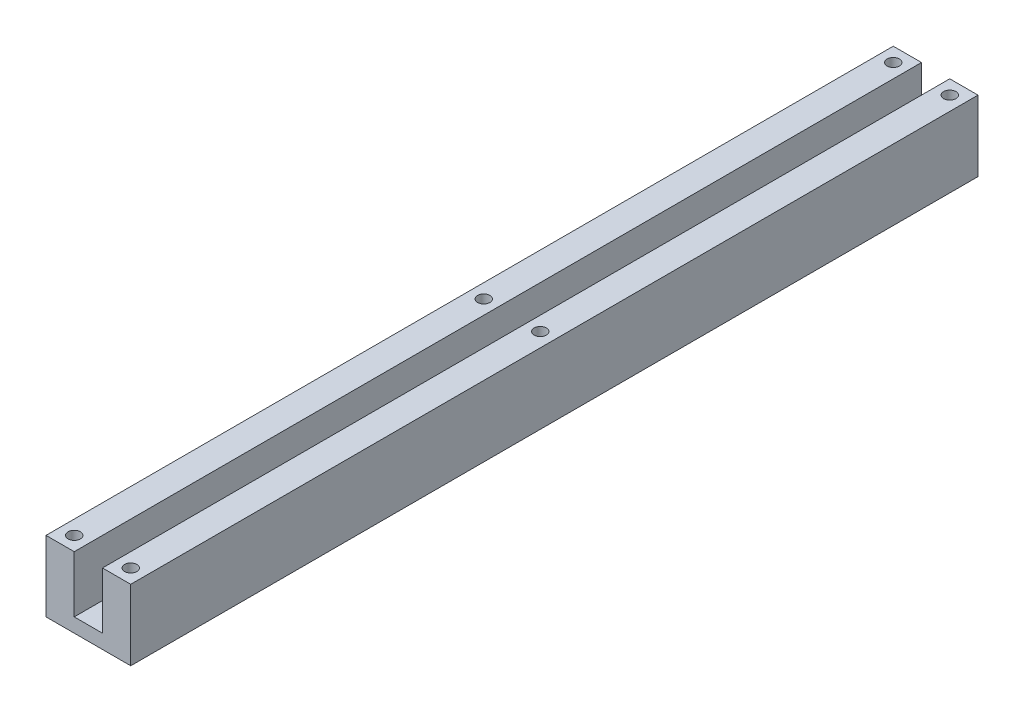
ISO-10303-21;
HEADER;
FILE_DESCRIPTION(('STEP AP214'),'2;1');
FILE_NAME('part.step','',(''),(''),'','','');
FILE_SCHEMA(('AUTOMOTIVE_DESIGN { 1 0 10303 214 1 1 1 1 }'));
ENDSEC;
DATA;
#1=APPLICATION_CONTEXT('core data for automotive mechanical design processes');
#2=APPLICATION_PROTOCOL_DEFINITION('international standard','automotive_design',2000,#1);
#3=PRODUCT_CONTEXT('',#1,'mechanical');
#4=PRODUCT('Part','Part','',(#3));
#5=PRODUCT_RELATED_PRODUCT_CATEGORY('part','',(#4));
#6=PRODUCT_DEFINITION_FORMATION('','',#4);
#7=PRODUCT_DEFINITION_CONTEXT('part definition',#1,'design');
#8=PRODUCT_DEFINITION('design','',#6,#7);
#9=PRODUCT_DEFINITION_SHAPE('','',#8);
#10=(LENGTH_UNIT() NAMED_UNIT(*) SI_UNIT(.MILLI.,.METRE.));
#11=(NAMED_UNIT(*) PLANE_ANGLE_UNIT() SI_UNIT($,.RADIAN.));
#12=(NAMED_UNIT(*) SI_UNIT($,.STERADIAN.) SOLID_ANGLE_UNIT());
#13=UNCERTAINTY_MEASURE_WITH_UNIT(LENGTH_MEASURE(1.E-05),#10,'distance_accuracy_value','');
#14=(GEOMETRIC_REPRESENTATION_CONTEXT(3) GLOBAL_UNCERTAINTY_ASSIGNED_CONTEXT((#13)) GLOBAL_UNIT_ASSIGNED_CONTEXT((#10,
#11,#12)) REPRESENTATION_CONTEXT('',''));
#15=CARTESIAN_POINT('',(0.,0.,0.));
#16=DIRECTION('',(0.,0.,1.));
#17=DIRECTION('',(1.,0.,0.));
#18=AXIS2_PLACEMENT_3D('',#15,#16,#17);
#19=CARTESIAN_POINT('',(-9.525,12.7,101.6));
#20=DIRECTION('',(1.,0.,0.));
#21=DIRECTION('',(0.,1.,0.));
#22=AXIS2_PLACEMENT_3D('',#19,#20,#21);
#23=PLANE('',#22);
#24=DIRECTION('',(0.,1.,0.));
#25=VECTOR('',#24,1.);
#26=CARTESIAN_POINT('',(-9.525,12.7,-88.9));
#27=LINE('',#26,#25);
#28=CARTESIAN_POINT('',(-9.525,-3.175,-88.9));
#29=VERTEX_POINT('',#28);
#30=CARTESIAN_POINT('',(-9.525,12.7,-88.9));
#31=VERTEX_POINT('',#30);
#32=EDGE_CURVE('E51',#29,#31,#27,.T.);
#33=ORIENTED_EDGE('',*,*,#32,.F.);
#34=DIRECTION('',(0.,0.,-1.));
#35=VECTOR('',#34,1.);
#36=CARTESIAN_POINT('',(-9.525,-3.175,101.6));
#37=LINE('',#36,#35);
#38=CARTESIAN_POINT('',(-9.525,-3.175,101.6));
#39=VERTEX_POINT('',#38);
#40=EDGE_CURVE('E11',#39,#29,#37,.T.);
#41=ORIENTED_EDGE('',*,*,#40,.F.);
#42=DIRECTION('',(0.,-1.,0.));
#43=VECTOR('',#42,1.);
#44=CARTESIAN_POINT('',(-9.525,12.7,101.6));
#45=LINE('',#44,#43);
#46=CARTESIAN_POINT('',(-9.525,12.7,101.6));
#47=VERTEX_POINT('',#46);
#48=EDGE_CURVE('E179',#47,#39,#45,.T.);
#49=ORIENTED_EDGE('',*,*,#48,.F.);
#50=DIRECTION('',(0.,0.,-1.));
#51=VECTOR('',#50,1.);
#52=CARTESIAN_POINT('',(-9.525,12.7,101.6));
#53=LINE('',#52,#51);
#54=EDGE_CURVE('E168',#47,#31,#53,.T.);
#55=ORIENTED_EDGE('',*,*,#54,.T.);
#56=EDGE_LOOP('',(#33,#41,#49,#55));
#57=FACE_BOUND('',#56,.T.);
#58=ADVANCED_FACE('F35',(#57),#23,.F.);
#59=CARTESIAN_POINT('',(-9.525,-3.175,101.6));
#60=DIRECTION('',(0.,1.,0.));
#61=DIRECTION('',(-1.,0.,0.));
#62=AXIS2_PLACEMENT_3D('',#59,#60,#61);
#63=PLANE('',#62);
#64=CARTESIAN_POINT('',(6.35,-3.175,98.425));
#65=DIRECTION('',(0.,1.,0.));
#66=DIRECTION('',(-1.,0.,0.));
#67=AXIS2_PLACEMENT_3D('',#64,#65,#66);
#68=CIRCLE('',#67,1.3890625);
#69=CARTESIAN_POINT('',(4.9609375,-3.175,98.425));
#70=VERTEX_POINT('',#69);
#71=EDGE_CURVE('E356',#70,#70,#68,.T.);
#72=ORIENTED_EDGE('',*,*,#71,.T.);
#73=EDGE_LOOP('',(#72));
#74=FACE_BOUND('',#73,.T.);
#75=CARTESIAN_POINT('',(-6.35,-3.175,6.35));
#76=DIRECTION('',(0.,1.,0.));
#77=DIRECTION('',(-1.,0.,0.));
#78=AXIS2_PLACEMENT_3D('',#75,#76,#77);
#79=CIRCLE('',#78,1.3890625);
#80=CARTESIAN_POINT('',(-7.7390625,-3.175,6.35));
#81=VERTEX_POINT('',#80);
#82=EDGE_CURVE('E354',#81,#81,#79,.T.);
#83=ORIENTED_EDGE('',*,*,#82,.T.);
#84=EDGE_LOOP('',(#83));
#85=FACE_BOUND('',#84,.T.);
#86=CARTESIAN_POINT('',(6.35,-3.175,6.35));
#87=DIRECTION('',(0.,1.,0.));
#88=DIRECTION('',(-1.,0.,0.));
#89=AXIS2_PLACEMENT_3D('',#86,#87,#88);
#90=CIRCLE('',#89,1.3890625);
#91=CARTESIAN_POINT('',(4.96093750000001,-3.175,6.35));
#92=VERTEX_POINT('',#91);
#93=EDGE_CURVE('E350',#92,#92,#90,.T.);
#94=ORIENTED_EDGE('',*,*,#93,.T.);
#95=EDGE_LOOP('',(#94));
#96=FACE_BOUND('',#95,.T.);
#97=CARTESIAN_POINT('',(-6.35,-3.175,-85.725));
#98=DIRECTION('',(0.,1.,0.));
#99=DIRECTION('',(-1.,0.,0.));
#100=AXIS2_PLACEMENT_3D('',#97,#98,#99);
#101=CIRCLE('',#100,1.3890625);
#102=CARTESIAN_POINT('',(-7.7390625,-3.175,-85.725));
#103=VERTEX_POINT('',#102);
#104=EDGE_CURVE('E347',#103,#103,#101,.T.);
#105=ORIENTED_EDGE('',*,*,#104,.T.);
#106=EDGE_LOOP('',(#105));
#107=FACE_BOUND('',#106,.T.);
#108=CARTESIAN_POINT('',(-6.35,-3.175,98.425));
#109=DIRECTION('',(0.,1.,0.));
#110=DIRECTION('',(-1.,0.,0.));
#111=AXIS2_PLACEMENT_3D('',#108,#109,#110);
#112=CIRCLE('',#111,1.3890625);
#113=CARTESIAN_POINT('',(-7.7390625,-3.175,98.425));
#114=VERTEX_POINT('',#113);
#115=EDGE_CURVE('E359',#114,#114,#112,.T.);
#116=ORIENTED_EDGE('',*,*,#115,.T.);
#117=EDGE_LOOP('',(#116));
#118=FACE_BOUND('',#117,.T.);
#119=CARTESIAN_POINT('',(6.35,-3.175,-85.725));
#120=DIRECTION('',(0.,1.,0.));
#121=DIRECTION('',(-1.,0.,0.));
#122=AXIS2_PLACEMENT_3D('',#119,#120,#121);
#123=CIRCLE('',#122,1.3890625);
#124=CARTESIAN_POINT('',(4.9609375,-3.175,-85.725));
#125=VERTEX_POINT('',#124);
#126=EDGE_CURVE('E129',#125,#125,#123,.T.);
#127=ORIENTED_EDGE('',*,*,#126,.T.);
#128=EDGE_LOOP('',(#127));
#129=FACE_BOUND('',#128,.T.);
#130=DIRECTION('',(-1.,0.,0.));
#131=VECTOR('',#130,1.);
#132=CARTESIAN_POINT('',(9.525,-3.175,-88.9));
#133=LINE('',#132,#131);
#134=CARTESIAN_POINT('',(9.525,-3.175,-88.9));
#135=VERTEX_POINT('',#134);
#136=EDGE_CURVE('E103',#135,#29,#133,.T.);
#137=ORIENTED_EDGE('',*,*,#136,.F.);
#138=DIRECTION('',(0.,0.,-1.));
#139=VECTOR('',#138,1.);
#140=CARTESIAN_POINT('',(9.525,-3.175,101.6));
#141=LINE('',#140,#139);
#142=CARTESIAN_POINT('',(9.525,-3.175,101.6));
#143=VERTEX_POINT('',#142);
#144=EDGE_CURVE('E43',#143,#135,#141,.T.);
#145=ORIENTED_EDGE('',*,*,#144,.F.);
#146=DIRECTION('',(1.,0.,0.));
#147=VECTOR('',#146,1.);
#148=CARTESIAN_POINT('',(-9.525,-3.175,101.6));
#149=LINE('',#148,#147);
#150=EDGE_CURVE('E181',#39,#143,#149,.T.);
#151=ORIENTED_EDGE('',*,*,#150,.F.);
#152=ORIENTED_EDGE('',*,*,#40,.T.);
#153=EDGE_LOOP('',(#137,#145,#151,#152));
#154=FACE_BOUND('',#153,.T.);
#155=ADVANCED_FACE('F113',(#74,#85,#96,#107,#118,#129,#154),#63,.F.);
#156=CARTESIAN_POINT('',(9.525,-3.175,101.6));
#157=DIRECTION('',(-1.,0.,0.));
#158=DIRECTION('',(0.,-1.,0.));
#159=AXIS2_PLACEMENT_3D('',#156,#157,#158);
#160=PLANE('',#159);
#161=DIRECTION('',(0.,-1.,0.));
#162=VECTOR('',#161,1.);
#163=CARTESIAN_POINT('',(9.525,12.7,-88.9));
#164=LINE('',#163,#162);
#165=CARTESIAN_POINT('',(9.525,12.7,-88.9));
#166=VERTEX_POINT('',#165);
#167=EDGE_CURVE('E100',#166,#135,#164,.T.);
#168=ORIENTED_EDGE('',*,*,#167,.F.);
#169=DIRECTION('',(0.,0.,-1.));
#170=VECTOR('',#169,1.);
#171=CARTESIAN_POINT('',(9.525,12.7,101.6));
#172=LINE('',#171,#170);
#173=CARTESIAN_POINT('',(9.525,12.7,101.6));
#174=VERTEX_POINT('',#173);
#175=EDGE_CURVE('E119',#174,#166,#172,.T.);
#176=ORIENTED_EDGE('',*,*,#175,.F.);
#177=DIRECTION('',(0.,1.,0.));
#178=VECTOR('',#177,1.);
#179=CARTESIAN_POINT('',(9.525,-3.175,101.6));
#180=LINE('',#179,#178);
#181=EDGE_CURVE('E118',#143,#174,#180,.T.);
#182=ORIENTED_EDGE('',*,*,#181,.F.);
#183=ORIENTED_EDGE('',*,*,#144,.T.);
#184=EDGE_LOOP('',(#168,#176,#182,#183));
#185=FACE_BOUND('',#184,.T.);
#186=ADVANCED_FACE('F117',(#185),#160,.F.);
#187=CARTESIAN_POINT('',(3.175,12.7,101.6));
#188=DIRECTION('',(0.,-1.,0.));
#189=DIRECTION('',(1.,0.,0.));
#190=AXIS2_PLACEMENT_3D('',#187,#188,#189);
#191=PLANE('',#190);
#192=CARTESIAN_POINT('',(6.35,12.7,98.425));
#193=DIRECTION('',(0.,-1.,0.));
#194=DIRECTION('',(1.,0.,0.));
#195=AXIS2_PLACEMENT_3D('',#192,#193,#194);
#196=CIRCLE('',#195,1.3890625);
#197=CARTESIAN_POINT('',(7.7390625,12.7,98.425));
#198=VERTEX_POINT('',#197);
#199=EDGE_CURVE('E38',#198,#198,#196,.T.);
#200=ORIENTED_EDGE('',*,*,#199,.T.);
#201=EDGE_LOOP('',(#200));
#202=FACE_BOUND('',#201,.T.);
#203=CARTESIAN_POINT('',(6.35,12.7,6.35));
#204=DIRECTION('',(0.,-1.,0.));
#205=DIRECTION('',(1.,0.,0.));
#206=AXIS2_PLACEMENT_3D('',#203,#204,#205);
#207=CIRCLE('',#206,1.3890625);
#208=CARTESIAN_POINT('',(7.7390625,12.7,6.35));
#209=VERTEX_POINT('',#208);
#210=EDGE_CURVE('E137',#209,#209,#207,.T.);
#211=ORIENTED_EDGE('',*,*,#210,.T.);
#212=EDGE_LOOP('',(#211));
#213=FACE_BOUND('',#212,.T.);
#214=CARTESIAN_POINT('',(6.35,12.7,-85.725));
#215=DIRECTION('',(0.,-1.,0.));
#216=DIRECTION('',(1.,0.,0.));
#217=AXIS2_PLACEMENT_3D('',#214,#215,#216);
#218=CIRCLE('',#217,1.3890625);
#219=CARTESIAN_POINT('',(7.7390625,12.7,-85.725));
#220=VERTEX_POINT('',#219);
#221=EDGE_CURVE('E135',#220,#220,#218,.T.);
#222=ORIENTED_EDGE('',*,*,#221,.T.);
#223=EDGE_LOOP('',(#222));
#224=FACE_BOUND('',#223,.T.);
#225=DIRECTION('',(1.,0.,0.));
#226=VECTOR('',#225,1.);
#227=CARTESIAN_POINT('',(9.525,12.7,-88.9));
#228=LINE('',#227,#226);
#229=CARTESIAN_POINT('',(3.175,12.7,-88.9));
#230=VERTEX_POINT('',#229);
#231=EDGE_CURVE('E105',#230,#166,#228,.T.);
#232=ORIENTED_EDGE('',*,*,#231,.F.);
#233=DIRECTION('',(0.,0.,-1.));
#234=VECTOR('',#233,1.);
#235=CARTESIAN_POINT('',(3.175,12.7,101.6));
#236=LINE('',#235,#234);
#237=CARTESIAN_POINT('',(3.175,12.7,101.6));
#238=VERTEX_POINT('',#237);
#239=EDGE_CURVE('E121',#238,#230,#236,.T.);
#240=ORIENTED_EDGE('',*,*,#239,.F.);
#241=DIRECTION('',(-1.,0.,0.));
#242=VECTOR('',#241,1.);
#243=CARTESIAN_POINT('',(3.175,12.7,101.6));
#244=LINE('',#243,#242);
#245=EDGE_CURVE('E184',#174,#238,#244,.T.);
#246=ORIENTED_EDGE('',*,*,#245,.F.);
#247=ORIENTED_EDGE('',*,*,#175,.T.);
#248=EDGE_LOOP('',(#232,#240,#246,#247));
#249=FACE_BOUND('',#248,.T.);
#250=ADVANCED_FACE('F144',(#202,#213,#224,#249),#191,.F.);
#251=CARTESIAN_POINT('',(3.175,0.,101.6));
#252=DIRECTION('',(1.,0.,0.));
#253=DIRECTION('',(0.,1.,0.));
#254=AXIS2_PLACEMENT_3D('',#251,#252,#253);
#255=PLANE('',#254);
#256=DIRECTION('',(0.,1.,0.));
#257=VECTOR('',#256,1.);
#258=CARTESIAN_POINT('',(3.175,0.,-88.9));
#259=LINE('',#258,#257);
#260=CARTESIAN_POINT('',(3.175,0.,-88.9));
#261=VERTEX_POINT('',#260);
#262=EDGE_CURVE('E177',#261,#230,#259,.T.);
#263=ORIENTED_EDGE('',*,*,#262,.F.);
#264=DIRECTION('',(0.,0.,-1.));
#265=VECTOR('',#264,1.);
#266=CARTESIAN_POINT('',(3.175,0.,101.6));
#267=LINE('',#266,#265);
#268=CARTESIAN_POINT('',(3.175,0.,101.6));
#269=VERTEX_POINT('',#268);
#270=EDGE_CURVE('E200',#269,#261,#267,.T.);
#271=ORIENTED_EDGE('',*,*,#270,.F.);
#272=DIRECTION('',(0.,-1.,0.));
#273=VECTOR('',#272,1.);
#274=CARTESIAN_POINT('',(3.175,0.,101.6));
#275=LINE('',#274,#273);
#276=EDGE_CURVE('E186',#238,#269,#275,.T.);
#277=ORIENTED_EDGE('',*,*,#276,.F.);
#278=ORIENTED_EDGE('',*,*,#239,.T.);
#279=EDGE_LOOP('',(#263,#271,#277,#278));
#280=FACE_BOUND('',#279,.T.);
#281=ADVANCED_FACE('F207',(#280),#255,.F.);
#282=CARTESIAN_POINT('',(-3.175,0.,101.6));
#283=DIRECTION('',(0.,-1.,0.));
#284=DIRECTION('',(1.,0.,0.));
#285=AXIS2_PLACEMENT_3D('',#282,#283,#284);
#286=PLANE('',#285);
#287=DIRECTION('',(1.,0.,0.));
#288=VECTOR('',#287,1.);
#289=CARTESIAN_POINT('',(-3.175,0.,-88.9));
#290=LINE('',#289,#288);
#291=CARTESIAN_POINT('',(-3.175,0.,-88.9));
#292=VERTEX_POINT('',#291);
#293=EDGE_CURVE('E175',#292,#261,#290,.T.);
#294=ORIENTED_EDGE('',*,*,#293,.F.);
#295=DIRECTION('',(0.,0.,-1.));
#296=VECTOR('',#295,1.);
#297=CARTESIAN_POINT('',(-3.175,0.,101.6));
#298=LINE('',#297,#296);
#299=CARTESIAN_POINT('',(-3.175,0.,101.6));
#300=VERTEX_POINT('',#299);
#301=EDGE_CURVE('E197',#300,#292,#298,.T.);
#302=ORIENTED_EDGE('',*,*,#301,.F.);
#303=DIRECTION('',(-1.,0.,0.));
#304=VECTOR('',#303,1.);
#305=CARTESIAN_POINT('',(-3.175,0.,101.6));
#306=LINE('',#305,#304);
#307=EDGE_CURVE('E188',#269,#300,#306,.T.);
#308=ORIENTED_EDGE('',*,*,#307,.F.);
#309=ORIENTED_EDGE('',*,*,#270,.T.);
#310=EDGE_LOOP('',(#294,#302,#308,#309));
#311=FACE_BOUND('',#310,.T.);
#312=ADVANCED_FACE('F216',(#311),#286,.F.);
#313=CARTESIAN_POINT('',(-3.175,12.7,101.6));
#314=DIRECTION('',(-1.,0.,0.));
#315=DIRECTION('',(0.,-1.,0.));
#316=AXIS2_PLACEMENT_3D('',#313,#314,#315);
#317=PLANE('',#316);
#318=DIRECTION('',(0.,-1.,0.));
#319=VECTOR('',#318,1.);
#320=CARTESIAN_POINT('',(-3.175,12.7,-88.9));
#321=LINE('',#320,#319);
#322=CARTESIAN_POINT('',(-3.175,12.7,-88.9));
#323=VERTEX_POINT('',#322);
#324=EDGE_CURVE('E173',#323,#292,#321,.T.);
#325=ORIENTED_EDGE('',*,*,#324,.F.);
#326=DIRECTION('',(0.,0.,-1.));
#327=VECTOR('',#326,1.);
#328=CARTESIAN_POINT('',(-3.175,12.7,101.6));
#329=LINE('',#328,#327);
#330=CARTESIAN_POINT('',(-3.175,12.7,101.6));
#331=VERTEX_POINT('',#330);
#332=EDGE_CURVE('E194',#331,#323,#329,.T.);
#333=ORIENTED_EDGE('',*,*,#332,.F.);
#334=DIRECTION('',(0.,1.,0.));
#335=VECTOR('',#334,1.);
#336=CARTESIAN_POINT('',(-3.175,12.7,101.6));
#337=LINE('',#336,#335);
#338=EDGE_CURVE('E190',#300,#331,#337,.T.);
#339=ORIENTED_EDGE('',*,*,#338,.F.);
#340=ORIENTED_EDGE('',*,*,#301,.T.);
#341=EDGE_LOOP('',(#325,#333,#339,#340));
#342=FACE_BOUND('',#341,.T.);
#343=ADVANCED_FACE('F221',(#342),#317,.F.);
#344=CARTESIAN_POINT('',(-9.525,12.7,101.6));
#345=DIRECTION('',(0.,-1.,0.));
#346=DIRECTION('',(0.,0.,-1.));
#347=AXIS2_PLACEMENT_3D('',#344,#345,#346);
#348=PLANE('',#347);
#349=CARTESIAN_POINT('',(-6.35,12.7,6.35));
#350=DIRECTION('',(0.,-1.,0.));
#351=DIRECTION('',(0.,0.,-1.));
#352=AXIS2_PLACEMENT_3D('',#349,#350,#351);
#353=CIRCLE('',#352,1.3890625);
#354=CARTESIAN_POINT('',(-6.35,12.7,4.9609375));
#355=VERTEX_POINT('',#354);
#356=EDGE_CURVE('E132',#355,#355,#353,.T.);
#357=ORIENTED_EDGE('',*,*,#356,.T.);
#358=EDGE_LOOP('',(#357));
#359=FACE_BOUND('',#358,.T.);
#360=CARTESIAN_POINT('',(-6.35,12.7,-85.725));
#361=DIRECTION('',(0.,-1.,0.));
#362=DIRECTION('',(0.,0.,-1.));
#363=AXIS2_PLACEMENT_3D('',#360,#361,#362);
#364=CIRCLE('',#363,1.3890625);
#365=CARTESIAN_POINT('',(-6.35,12.7,-87.1140625));
#366=VERTEX_POINT('',#365);
#367=EDGE_CURVE('E128',#366,#366,#364,.T.);
#368=ORIENTED_EDGE('',*,*,#367,.T.);
#369=EDGE_LOOP('',(#368));
#370=FACE_BOUND('',#369,.T.);
#371=CARTESIAN_POINT('',(-6.35,12.7,98.425));
#372=DIRECTION('',(0.,-1.,0.));
#373=DIRECTION('',(0.,0.,-1.));
#374=AXIS2_PLACEMENT_3D('',#371,#372,#373);
#375=CIRCLE('',#374,1.3890625);
#376=CARTESIAN_POINT('',(-6.35,12.7,97.0359375));
#377=VERTEX_POINT('',#376);
#378=EDGE_CURVE('E125',#377,#377,#375,.T.);
#379=ORIENTED_EDGE('',*,*,#378,.T.);
#380=EDGE_LOOP('',(#379));
#381=FACE_BOUND('',#380,.T.);
#382=EDGE_CURVE('E170',#31,#323,#228,.T.);
#383=ORIENTED_EDGE('',*,*,#382,.F.);
#384=ORIENTED_EDGE('',*,*,#54,.F.);
#385=DIRECTION('',(-1.,0.,0.));
#386=VECTOR('',#385,1.);
#387=CARTESIAN_POINT('',(-9.525,12.7,101.6));
#388=LINE('',#387,#386);
#389=EDGE_CURVE('E59',#331,#47,#388,.T.);
#390=ORIENTED_EDGE('',*,*,#389,.F.);
#391=ORIENTED_EDGE('',*,*,#332,.T.);
#392=EDGE_LOOP('',(#383,#384,#390,#391));
#393=FACE_BOUND('',#392,.T.);
#394=ADVANCED_FACE('F223',(#359,#370,#381,#393),#348,.F.);
#395=CARTESIAN_POINT('',(0.,0.,101.6));
#396=DIRECTION('',(0.,0.,1.));
#397=DIRECTION('',(1.,0.,0.));
#398=AXIS2_PLACEMENT_3D('',#395,#396,#397);
#399=PLANE('',#398);
#400=ORIENTED_EDGE('',*,*,#48,.T.);
#401=ORIENTED_EDGE('',*,*,#150,.T.);
#402=ORIENTED_EDGE('',*,*,#181,.T.);
#403=ORIENTED_EDGE('',*,*,#245,.T.);
#404=ORIENTED_EDGE('',*,*,#276,.T.);
#405=ORIENTED_EDGE('',*,*,#307,.T.);
#406=ORIENTED_EDGE('',*,*,#338,.T.);
#407=ORIENTED_EDGE('',*,*,#389,.T.);
#408=EDGE_LOOP('',(#400,#401,#402,#403,#404,#405,#406,#407));
#409=FACE_BOUND('',#408,.T.);
#410=ADVANCED_FACE('F211',(#409),#399,.T.);
#411=CARTESIAN_POINT('',(0.,0.,-88.9));
#412=DIRECTION('',(0.,0.,-1.));
#413=DIRECTION('',(-1.,0.,0.));
#414=AXIS2_PLACEMENT_3D('',#411,#412,#413);
#415=PLANE('',#414);
#416=ORIENTED_EDGE('',*,*,#262,.T.);
#417=ORIENTED_EDGE('',*,*,#231,.T.);
#418=ORIENTED_EDGE('',*,*,#167,.T.);
#419=ORIENTED_EDGE('',*,*,#136,.T.);
#420=ORIENTED_EDGE('',*,*,#32,.T.);
#421=ORIENTED_EDGE('',*,*,#382,.T.);
#422=ORIENTED_EDGE('',*,*,#324,.T.);
#423=ORIENTED_EDGE('',*,*,#293,.T.);
#424=EDGE_LOOP('',(#416,#417,#418,#419,#420,#421,#422,#423));
#425=FACE_BOUND('',#424,.T.);
#426=ADVANCED_FACE('F102',(#425),#415,.T.);
#427=CARTESIAN_POINT('',(-6.35,-3.175,98.425));
#428=DIRECTION('',(0.,1.,0.));
#429=DIRECTION('',(-1.,0.,0.));
#430=AXIS2_PLACEMENT_3D('',#427,#428,#429);
#431=CYLINDRICAL_SURFACE('',#430,1.3890625);
#432=ORIENTED_EDGE('',*,*,#115,.F.);
#433=EDGE_LOOP('',(#432));
#434=FACE_BOUND('',#433,.T.);
#435=ORIENTED_EDGE('',*,*,#378,.F.);
#436=EDGE_LOOP('',(#435));
#437=FACE_BOUND('',#436,.T.);
#438=ADVANCED_FACE('F272',(#434,#437),#431,.F.);
#439=CARTESIAN_POINT('',(-6.35,-3.175,-85.725));
#440=DIRECTION('',(0.,1.,0.));
#441=DIRECTION('',(-1.,0.,0.));
#442=AXIS2_PLACEMENT_3D('',#439,#440,#441);
#443=CYLINDRICAL_SURFACE('',#442,1.3890625);
#444=ORIENTED_EDGE('',*,*,#104,.F.);
#445=EDGE_LOOP('',(#444));
#446=FACE_BOUND('',#445,.T.);
#447=ORIENTED_EDGE('',*,*,#367,.F.);
#448=EDGE_LOOP('',(#447));
#449=FACE_BOUND('',#448,.T.);
#450=ADVANCED_FACE('F300',(#446,#449),#443,.F.);
#451=CARTESIAN_POINT('',(-6.35,-3.175,6.35));
#452=DIRECTION('',(0.,1.,0.));
#453=DIRECTION('',(-1.,0.,0.));
#454=AXIS2_PLACEMENT_3D('',#451,#452,#453);
#455=CYLINDRICAL_SURFACE('',#454,1.3890625);
#456=ORIENTED_EDGE('',*,*,#82,.F.);
#457=EDGE_LOOP('',(#456));
#458=FACE_BOUND('',#457,.T.);
#459=ORIENTED_EDGE('',*,*,#356,.F.);
#460=EDGE_LOOP('',(#459));
#461=FACE_BOUND('',#460,.T.);
#462=ADVANCED_FACE('F310',(#458,#461),#455,.F.);
#463=CARTESIAN_POINT('',(6.35,-3.175,-85.725));
#464=DIRECTION('',(0.,1.,0.));
#465=DIRECTION('',(-1.,0.,0.));
#466=AXIS2_PLACEMENT_3D('',#463,#464,#465);
#467=CYLINDRICAL_SURFACE('',#466,1.3890625);
#468=ORIENTED_EDGE('',*,*,#126,.F.);
#469=EDGE_LOOP('',(#468));
#470=FACE_BOUND('',#469,.T.);
#471=ORIENTED_EDGE('',*,*,#221,.F.);
#472=EDGE_LOOP('',(#471));
#473=FACE_BOUND('',#472,.T.);
#474=ADVANCED_FACE('F154',(#470,#473),#467,.F.);
#475=CARTESIAN_POINT('',(6.35,-3.175,6.35));
#476=DIRECTION('',(0.,1.,0.));
#477=DIRECTION('',(-1.,0.,0.));
#478=AXIS2_PLACEMENT_3D('',#475,#476,#477);
#479=CYLINDRICAL_SURFACE('',#478,1.3890625);
#480=ORIENTED_EDGE('',*,*,#93,.F.);
#481=EDGE_LOOP('',(#480));
#482=FACE_BOUND('',#481,.T.);
#483=ORIENTED_EDGE('',*,*,#210,.F.);
#484=EDGE_LOOP('',(#483));
#485=FACE_BOUND('',#484,.T.);
#486=ADVANCED_FACE('F148',(#482,#485),#479,.F.);
#487=CARTESIAN_POINT('',(6.35,-3.175,98.425));
#488=DIRECTION('',(0.,1.,0.));
#489=DIRECTION('',(-1.,0.,0.));
#490=AXIS2_PLACEMENT_3D('',#487,#488,#489);
#491=CYLINDRICAL_SURFACE('',#490,1.3890625);
#492=ORIENTED_EDGE('',*,*,#71,.F.);
#493=EDGE_LOOP('',(#492));
#494=FACE_BOUND('',#493,.T.);
#495=ORIENTED_EDGE('',*,*,#199,.F.);
#496=EDGE_LOOP('',(#495));
#497=FACE_BOUND('',#496,.T.);
#498=ADVANCED_FACE('F146',(#494,#497),#491,.F.);
#499=CLOSED_SHELL('',(#58,#155,#186,#250,#281,#312,#343,#394,#410,#426,#438,#450,#462,#474,#486,#498));
#500=MANIFOLD_SOLID_BREP('B2',#499);
#501=ADVANCED_BREP_SHAPE_REPRESENTATION('',(#18,#500),#14);
#502=SHAPE_DEFINITION_REPRESENTATION(#9,#501);
ENDSEC;
END-ISO-10303-21;
